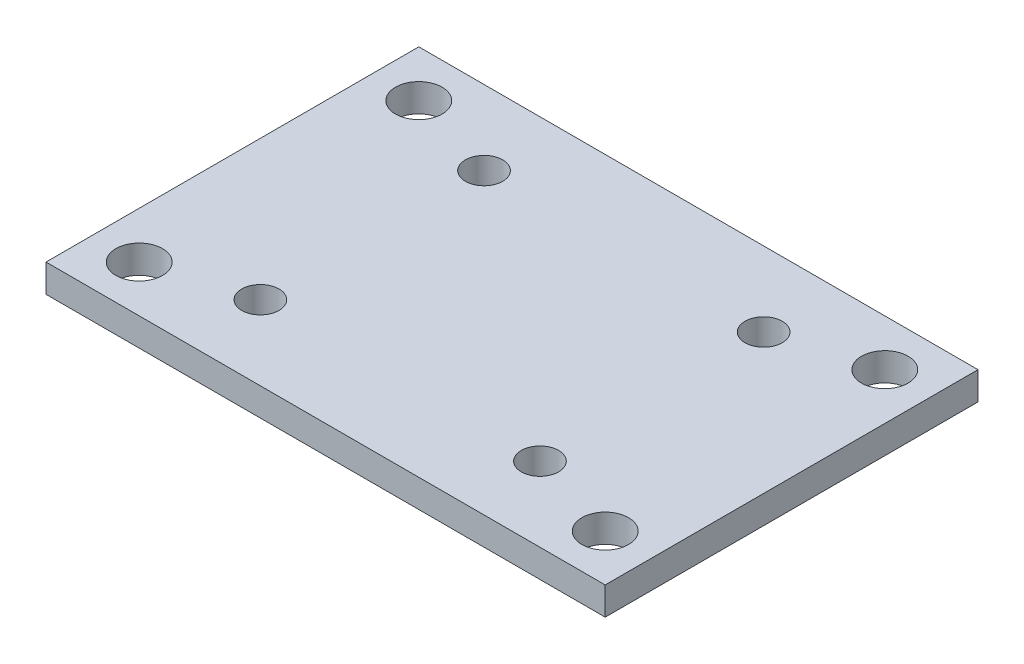
ISO-10303-21;
HEADER;
FILE_DESCRIPTION(('STEP AP214'),'2;1');
FILE_NAME('part.step','',(''),(''),'','','');
FILE_SCHEMA(('AUTOMOTIVE_DESIGN { 1 0 10303 214 1 1 1 1 }'));
ENDSEC;
DATA;
#1=APPLICATION_CONTEXT('core data for automotive mechanical design processes');
#2=APPLICATION_PROTOCOL_DEFINITION('international standard','automotive_design',2000,#1);
#3=PRODUCT_CONTEXT('',#1,'mechanical');
#4=PRODUCT('Part','Part','',(#3));
#5=PRODUCT_RELATED_PRODUCT_CATEGORY('part','',(#4));
#6=PRODUCT_DEFINITION_FORMATION('','',#4);
#7=PRODUCT_DEFINITION_CONTEXT('part definition',#1,'design');
#8=PRODUCT_DEFINITION('design','',#6,#7);
#9=PRODUCT_DEFINITION_SHAPE('','',#8);
#10=(LENGTH_UNIT() NAMED_UNIT(*) SI_UNIT(.MILLI.,.METRE.));
#11=(NAMED_UNIT(*) PLANE_ANGLE_UNIT() SI_UNIT($,.RADIAN.));
#12=(NAMED_UNIT(*) SI_UNIT($,.STERADIAN.) SOLID_ANGLE_UNIT());
#13=UNCERTAINTY_MEASURE_WITH_UNIT(LENGTH_MEASURE(1.E-05),#10,'distance_accuracy_value','');
#14=(GEOMETRIC_REPRESENTATION_CONTEXT(3) GLOBAL_UNCERTAINTY_ASSIGNED_CONTEXT((#13)) GLOBAL_UNIT_ASSIGNED_CONTEXT((#10,
#11,#12)) REPRESENTATION_CONTEXT('',''));
#15=CARTESIAN_POINT('',(0.,0.,0.));
#16=DIRECTION('',(0.,0.,1.));
#17=DIRECTION('',(1.,0.,0.));
#18=AXIS2_PLACEMENT_3D('',#15,#16,#17);
#19=CARTESIAN_POINT('',(-30.,3.,20.));
#20=DIRECTION('',(1.,0.,0.));
#21=DIRECTION('',(0.,0.,-1.));
#22=AXIS2_PLACEMENT_3D('',#19,#20,#21);
#23=PLANE('',#22);
#24=DIRECTION('',(0.,0.,1.));
#25=VECTOR('',#24,1.);
#26=CARTESIAN_POINT('',(-30.,0.,20.));
#27=LINE('',#26,#25);
#28=CARTESIAN_POINT('',(-30.,0.,-20.));
#29=VERTEX_POINT('',#28);
#30=CARTESIAN_POINT('',(-30.,0.,20.));
#31=VERTEX_POINT('',#30);
#32=EDGE_CURVE('E96',#29,#31,#27,.T.);
#33=ORIENTED_EDGE('',*,*,#32,.T.);
#34=DIRECTION('',(0.,-1.,0.));
#35=VECTOR('',#34,1.);
#36=CARTESIAN_POINT('',(-30.,3.,20.));
#37=LINE('',#36,#35);
#38=CARTESIAN_POINT('',(-30.,3.,20.));
#39=VERTEX_POINT('',#38);
#40=EDGE_CURVE('E11',#39,#31,#37,.T.);
#41=ORIENTED_EDGE('',*,*,#40,.F.);
#42=DIRECTION('',(0.,0.,1.));
#43=VECTOR('',#42,1.);
#44=CARTESIAN_POINT('',(-30.,3.,20.));
#45=LINE('',#44,#43);
#46=CARTESIAN_POINT('',(-30.,3.,-20.));
#47=VERTEX_POINT('',#46);
#48=EDGE_CURVE('E84',#47,#39,#45,.T.);
#49=ORIENTED_EDGE('',*,*,#48,.F.);
#50=DIRECTION('',(0.,-1.,0.));
#51=VECTOR('',#50,1.);
#52=CARTESIAN_POINT('',(-30.,3.,-20.));
#53=LINE('',#52,#51);
#54=EDGE_CURVE('E92',#47,#29,#53,.T.);
#55=ORIENTED_EDGE('',*,*,#54,.T.);
#56=EDGE_LOOP('',(#33,#41,#49,#55));
#57=FACE_BOUND('',#56,.T.);
#58=ADVANCED_FACE('F33',(#57),#23,.F.);
#59=CARTESIAN_POINT('',(30.,3.,20.));
#60=DIRECTION('',(0.,0.,-1.));
#61=DIRECTION('',(-1.,0.,0.));
#62=AXIS2_PLACEMENT_3D('',#59,#60,#61);
#63=PLANE('',#62);
#64=DIRECTION('',(1.,0.,0.));
#65=VECTOR('',#64,1.);
#66=CARTESIAN_POINT('',(30.,0.,20.));
#67=LINE('',#66,#65);
#68=CARTESIAN_POINT('',(30.,0.,20.));
#69=VERTEX_POINT('',#68);
#70=EDGE_CURVE('E88',#31,#69,#67,.T.);
#71=ORIENTED_EDGE('',*,*,#70,.T.);
#72=DIRECTION('',(0.,-1.,0.));
#73=VECTOR('',#72,1.);
#74=CARTESIAN_POINT('',(30.,3.,20.));
#75=LINE('',#74,#73);
#76=CARTESIAN_POINT('',(30.,3.,20.));
#77=VERTEX_POINT('',#76);
#78=EDGE_CURVE('E41',#77,#69,#75,.T.);
#79=ORIENTED_EDGE('',*,*,#78,.F.);
#80=DIRECTION('',(1.,0.,0.));
#81=VECTOR('',#80,1.);
#82=CARTESIAN_POINT('',(30.,3.,20.));
#83=LINE('',#82,#81);
#84=EDGE_CURVE('E79',#39,#77,#83,.T.);
#85=ORIENTED_EDGE('',*,*,#84,.F.);
#86=ORIENTED_EDGE('',*,*,#40,.T.);
#87=EDGE_LOOP('',(#71,#79,#85,#86));
#88=FACE_BOUND('',#87,.T.);
#89=ADVANCED_FACE('F87',(#88),#63,.F.);
#90=CARTESIAN_POINT('',(30.,3.,20.));
#91=DIRECTION('',(-1.,0.,0.));
#92=DIRECTION('',(0.,0.,1.));
#93=AXIS2_PLACEMENT_3D('',#90,#91,#92);
#94=PLANE('',#93);
#95=DIRECTION('',(0.,0.,-1.));
#96=VECTOR('',#95,1.);
#97=CARTESIAN_POINT('',(30.,0.,20.));
#98=LINE('',#97,#96);
#99=CARTESIAN_POINT('',(30.,0.,-20.));
#100=VERTEX_POINT('',#99);
#101=EDGE_CURVE('E66',#69,#100,#98,.T.);
#102=ORIENTED_EDGE('',*,*,#101,.T.);
#103=DIRECTION('',(0.,-1.,0.));
#104=VECTOR('',#103,1.);
#105=CARTESIAN_POINT('',(30.,3.,-20.));
#106=LINE('',#105,#104);
#107=CARTESIAN_POINT('',(30.,3.,-20.));
#108=VERTEX_POINT('',#107);
#109=EDGE_CURVE('E89',#108,#100,#106,.T.);
#110=ORIENTED_EDGE('',*,*,#109,.F.);
#111=DIRECTION('',(0.,0.,-1.));
#112=VECTOR('',#111,1.);
#113=CARTESIAN_POINT('',(30.,3.,20.));
#114=LINE('',#113,#112);
#115=EDGE_CURVE('E82',#77,#108,#114,.T.);
#116=ORIENTED_EDGE('',*,*,#115,.F.);
#117=ORIENTED_EDGE('',*,*,#78,.T.);
#118=EDGE_LOOP('',(#102,#110,#116,#117));
#119=FACE_BOUND('',#118,.T.);
#120=ADVANCED_FACE('F90',(#119),#94,.F.);
#121=CARTESIAN_POINT('',(30.,3.,-20.));
#122=DIRECTION('',(0.,0.,1.));
#123=DIRECTION('',(1.,0.,0.));
#124=AXIS2_PLACEMENT_3D('',#121,#122,#123);
#125=PLANE('',#124);
#126=DIRECTION('',(-1.,0.,0.));
#127=VECTOR('',#126,1.);
#128=CARTESIAN_POINT('',(30.,0.,-20.));
#129=LINE('',#128,#127);
#130=EDGE_CURVE('E72',#100,#29,#129,.T.);
#131=ORIENTED_EDGE('',*,*,#130,.T.);
#132=ORIENTED_EDGE('',*,*,#54,.F.);
#133=DIRECTION('',(-1.,0.,0.));
#134=VECTOR('',#133,1.);
#135=CARTESIAN_POINT('',(30.,3.,-20.));
#136=LINE('',#135,#134);
#137=EDGE_CURVE('E49',#108,#47,#136,.T.);
#138=ORIENTED_EDGE('',*,*,#137,.F.);
#139=ORIENTED_EDGE('',*,*,#109,.T.);
#140=EDGE_LOOP('',(#131,#132,#138,#139));
#141=FACE_BOUND('',#140,.T.);
#142=ADVANCED_FACE('F104',(#141),#125,.F.);
#143=CARTESIAN_POINT('',(0.,3.,0.));
#144=DIRECTION('',(0.,1.,0.));
#145=DIRECTION('',(0.,0.,1.));
#146=AXIS2_PLACEMENT_3D('',#143,#144,#145);
#147=PLANE('',#146);
#148=CARTESIAN_POINT('',(-25.,3.,15.));
#149=DIRECTION('',(0.,1.,0.));
#150=DIRECTION('',(0.,0.,1.));
#151=AXIS2_PLACEMENT_3D('',#148,#149,#150);
#152=CIRCLE('',#151,2.5);
#153=CARTESIAN_POINT('',(-25.,3.,17.5));
#154=VERTEX_POINT('',#153);
#155=EDGE_CURVE('E147',#154,#154,#152,.T.);
#156=ORIENTED_EDGE('',*,*,#155,.F.);
#157=EDGE_LOOP('',(#156));
#158=FACE_BOUND('',#157,.T.);
#159=CARTESIAN_POINT('',(25.,3.,-15.));
#160=DIRECTION('',(0.,1.,0.));
#161=DIRECTION('',(0.,0.,1.));
#162=AXIS2_PLACEMENT_3D('',#159,#160,#161);
#163=CIRCLE('',#162,2.5);
#164=CARTESIAN_POINT('',(25.,3.,-12.5));
#165=VERTEX_POINT('',#164);
#166=EDGE_CURVE('E140',#165,#165,#163,.T.);
#167=ORIENTED_EDGE('',*,*,#166,.F.);
#168=EDGE_LOOP('',(#167));
#169=FACE_BOUND('',#168,.T.);
#170=CARTESIAN_POINT('',(25.,3.,15.));
#171=DIRECTION('',(0.,1.,0.));
#172=DIRECTION('',(0.,0.,1.));
#173=AXIS2_PLACEMENT_3D('',#170,#171,#172);
#174=CIRCLE('',#173,2.5);
#175=CARTESIAN_POINT('',(25.,3.,17.5));
#176=VERTEX_POINT('',#175);
#177=EDGE_CURVE('E152',#176,#176,#174,.T.);
#178=ORIENTED_EDGE('',*,*,#177,.F.);
#179=EDGE_LOOP('',(#178));
#180=FACE_BOUND('',#179,.T.);
#181=CARTESIAN_POINT('',(-25.,3.,-15.));
#182=DIRECTION('',(0.,1.,0.));
#183=DIRECTION('',(0.,0.,1.));
#184=AXIS2_PLACEMENT_3D('',#181,#182,#183);
#185=CIRCLE('',#184,2.5);
#186=CARTESIAN_POINT('',(-25.,3.,-12.5));
#187=VERTEX_POINT('',#186);
#188=EDGE_CURVE('E134',#187,#187,#185,.T.);
#189=ORIENTED_EDGE('',*,*,#188,.F.);
#190=EDGE_LOOP('',(#189));
#191=FACE_BOUND('',#190,.T.);
#192=CARTESIAN_POINT('',(-15.,3.,12.));
#193=DIRECTION('',(0.,1.,0.));
#194=DIRECTION('',(0.,0.,1.));
#195=AXIS2_PLACEMENT_3D('',#192,#193,#194);
#196=CIRCLE('',#195,2.);
#197=CARTESIAN_POINT('',(-15.,3.,14.));
#198=VERTEX_POINT('',#197);
#199=EDGE_CURVE('E116',#198,#198,#196,.T.);
#200=ORIENTED_EDGE('',*,*,#199,.F.);
#201=EDGE_LOOP('',(#200));
#202=FACE_BOUND('',#201,.T.);
#203=CARTESIAN_POINT('',(15.,3.,12.));
#204=DIRECTION('',(0.,1.,0.));
#205=DIRECTION('',(0.,0.,1.));
#206=AXIS2_PLACEMENT_3D('',#203,#204,#205);
#207=CIRCLE('',#206,2.);
#208=CARTESIAN_POINT('',(15.,3.,14.));
#209=VERTEX_POINT('',#208);
#210=EDGE_CURVE('E123',#209,#209,#207,.T.);
#211=ORIENTED_EDGE('',*,*,#210,.F.);
#212=EDGE_LOOP('',(#211));
#213=FACE_BOUND('',#212,.T.);
#214=CARTESIAN_POINT('',(15.,3.,-12.));
#215=DIRECTION('',(0.,1.,0.));
#216=DIRECTION('',(0.,0.,1.));
#217=AXIS2_PLACEMENT_3D('',#214,#215,#216);
#218=CIRCLE('',#217,2.);
#219=CARTESIAN_POINT('',(15.,3.,-10.));
#220=VERTEX_POINT('',#219);
#221=EDGE_CURVE('E129',#220,#220,#218,.T.);
#222=ORIENTED_EDGE('',*,*,#221,.F.);
#223=EDGE_LOOP('',(#222));
#224=FACE_BOUND('',#223,.T.);
#225=CARTESIAN_POINT('',(-15.,3.,-12.));
#226=DIRECTION('',(0.,1.,0.));
#227=DIRECTION('',(0.,0.,1.));
#228=AXIS2_PLACEMENT_3D('',#225,#226,#227);
#229=CIRCLE('',#228,2.);
#230=CARTESIAN_POINT('',(-15.,3.,-10.));
#231=VERTEX_POINT('',#230);
#232=EDGE_CURVE('E110',#231,#231,#229,.T.);
#233=ORIENTED_EDGE('',*,*,#232,.F.);
#234=EDGE_LOOP('',(#233));
#235=FACE_BOUND('',#234,.T.);
#236=ORIENTED_EDGE('',*,*,#48,.T.);
#237=ORIENTED_EDGE('',*,*,#84,.T.);
#238=ORIENTED_EDGE('',*,*,#115,.T.);
#239=ORIENTED_EDGE('',*,*,#137,.T.);
#240=EDGE_LOOP('',(#236,#237,#238,#239));
#241=FACE_BOUND('',#240,.T.);
#242=ADVANCED_FACE('F80',(#158,#169,#180,#191,#202,#213,#224,#235,#241),#147,.T.);
#243=CARTESIAN_POINT('',(0.,0.,0.));
#244=DIRECTION('',(0.,1.,0.));
#245=DIRECTION('',(0.,0.,1.));
#246=AXIS2_PLACEMENT_3D('',#243,#244,#245);
#247=PLANE('',#246);
#248=CARTESIAN_POINT('',(-25.,0.,15.));
#249=DIRECTION('',(0.,1.,0.));
#250=DIRECTION('',(0.,0.,1.));
#251=AXIS2_PLACEMENT_3D('',#248,#249,#250);
#252=CIRCLE('',#251,2.5);
#253=CARTESIAN_POINT('',(-25.,0.,17.5));
#254=VERTEX_POINT('',#253);
#255=EDGE_CURVE('E137',#254,#254,#252,.T.);
#256=ORIENTED_EDGE('',*,*,#255,.T.);
#257=EDGE_LOOP('',(#256));
#258=FACE_BOUND('',#257,.T.);
#259=CARTESIAN_POINT('',(25.,0.,-15.));
#260=DIRECTION('',(0.,1.,0.));
#261=DIRECTION('',(0.,0.,1.));
#262=AXIS2_PLACEMENT_3D('',#259,#260,#261);
#263=CIRCLE('',#262,2.5);
#264=CARTESIAN_POINT('',(25.,0.,-12.5));
#265=VERTEX_POINT('',#264);
#266=EDGE_CURVE('E143',#265,#265,#263,.T.);
#267=ORIENTED_EDGE('',*,*,#266,.T.);
#268=EDGE_LOOP('',(#267));
#269=FACE_BOUND('',#268,.T.);
#270=CARTESIAN_POINT('',(25.,0.,15.));
#271=DIRECTION('',(0.,1.,0.));
#272=DIRECTION('',(0.,0.,1.));
#273=AXIS2_PLACEMENT_3D('',#270,#271,#272);
#274=CIRCLE('',#273,2.5);
#275=CARTESIAN_POINT('',(25.,0.,17.5));
#276=VERTEX_POINT('',#275);
#277=EDGE_CURVE('E144',#276,#276,#274,.T.);
#278=ORIENTED_EDGE('',*,*,#277,.T.);
#279=EDGE_LOOP('',(#278));
#280=FACE_BOUND('',#279,.T.);
#281=CARTESIAN_POINT('',(-25.,0.,-15.));
#282=DIRECTION('',(0.,1.,0.));
#283=DIRECTION('',(0.,0.,1.));
#284=AXIS2_PLACEMENT_3D('',#281,#282,#283);
#285=CIRCLE('',#284,2.5);
#286=CARTESIAN_POINT('',(-25.,0.,-12.5));
#287=VERTEX_POINT('',#286);
#288=EDGE_CURVE('E120',#287,#287,#285,.T.);
#289=ORIENTED_EDGE('',*,*,#288,.T.);
#290=EDGE_LOOP('',(#289));
#291=FACE_BOUND('',#290,.T.);
#292=CARTESIAN_POINT('',(-15.,0.,12.));
#293=DIRECTION('',(0.,1.,0.));
#294=DIRECTION('',(0.,0.,1.));
#295=AXIS2_PLACEMENT_3D('',#292,#293,#294);
#296=CIRCLE('',#295,2.);
#297=CARTESIAN_POINT('',(-15.,0.,14.));
#298=VERTEX_POINT('',#297);
#299=EDGE_CURVE('E119',#298,#298,#296,.T.);
#300=ORIENTED_EDGE('',*,*,#299,.T.);
#301=EDGE_LOOP('',(#300));
#302=FACE_BOUND('',#301,.T.);
#303=CARTESIAN_POINT('',(15.,0.,12.));
#304=DIRECTION('',(0.,1.,0.));
#305=DIRECTION('',(0.,0.,1.));
#306=AXIS2_PLACEMENT_3D('',#303,#304,#305);
#307=CIRCLE('',#306,2.);
#308=CARTESIAN_POINT('',(15.,0.,14.));
#309=VERTEX_POINT('',#308);
#310=EDGE_CURVE('E126',#309,#309,#307,.T.);
#311=ORIENTED_EDGE('',*,*,#310,.T.);
#312=EDGE_LOOP('',(#311));
#313=FACE_BOUND('',#312,.T.);
#314=CARTESIAN_POINT('',(15.,0.,-12.));
#315=DIRECTION('',(0.,1.,0.));
#316=DIRECTION('',(0.,0.,1.));
#317=AXIS2_PLACEMENT_3D('',#314,#315,#316);
#318=CIRCLE('',#317,2.);
#319=CARTESIAN_POINT('',(15.,0.,-10.));
#320=VERTEX_POINT('',#319);
#321=EDGE_CURVE('E113',#320,#320,#318,.T.);
#322=ORIENTED_EDGE('',*,*,#321,.T.);
#323=EDGE_LOOP('',(#322));
#324=FACE_BOUND('',#323,.T.);
#325=CARTESIAN_POINT('',(-15.,0.,-12.));
#326=DIRECTION('',(0.,1.,0.));
#327=DIRECTION('',(0.,0.,1.));
#328=AXIS2_PLACEMENT_3D('',#325,#326,#327);
#329=CIRCLE('',#328,2.);
#330=CARTESIAN_POINT('',(-15.,0.,-10.));
#331=VERTEX_POINT('',#330);
#332=EDGE_CURVE('E99',#331,#331,#329,.T.);
#333=ORIENTED_EDGE('',*,*,#332,.T.);
#334=EDGE_LOOP('',(#333));
#335=FACE_BOUND('',#334,.T.);
#336=ORIENTED_EDGE('',*,*,#32,.F.);
#337=ORIENTED_EDGE('',*,*,#130,.F.);
#338=ORIENTED_EDGE('',*,*,#101,.F.);
#339=ORIENTED_EDGE('',*,*,#70,.F.);
#340=EDGE_LOOP('',(#336,#337,#338,#339));
#341=FACE_BOUND('',#340,.T.);
#342=ADVANCED_FACE('F107',(#258,#269,#280,#291,#302,#313,#324,#335,#341),#247,.F.);
#343=CARTESIAN_POINT('',(-15.,0.,-12.));
#344=DIRECTION('',(0.,1.,0.));
#345=DIRECTION('',(0.,0.,1.));
#346=AXIS2_PLACEMENT_3D('',#343,#344,#345);
#347=CYLINDRICAL_SURFACE('',#346,2.);
#348=ORIENTED_EDGE('',*,*,#332,.F.);
#349=EDGE_LOOP('',(#348));
#350=FACE_BOUND('',#349,.T.);
#351=ORIENTED_EDGE('',*,*,#232,.T.);
#352=EDGE_LOOP('',(#351));
#353=FACE_BOUND('',#352,.T.);
#354=ADVANCED_FACE('F182',(#350,#353),#347,.F.);
#355=CARTESIAN_POINT('',(15.,0.,-12.));
#356=DIRECTION('',(0.,1.,0.));
#357=DIRECTION('',(0.,0.,1.));
#358=AXIS2_PLACEMENT_3D('',#355,#356,#357);
#359=CYLINDRICAL_SURFACE('',#358,2.);
#360=ORIENTED_EDGE('',*,*,#321,.F.);
#361=EDGE_LOOP('',(#360));
#362=FACE_BOUND('',#361,.T.);
#363=ORIENTED_EDGE('',*,*,#221,.T.);
#364=EDGE_LOOP('',(#363));
#365=FACE_BOUND('',#364,.T.);
#366=ADVANCED_FACE('F184',(#362,#365),#359,.F.);
#367=CARTESIAN_POINT('',(15.,0.,12.));
#368=DIRECTION('',(0.,1.,0.));
#369=DIRECTION('',(0.,0.,1.));
#370=AXIS2_PLACEMENT_3D('',#367,#368,#369);
#371=CYLINDRICAL_SURFACE('',#370,2.);
#372=ORIENTED_EDGE('',*,*,#310,.F.);
#373=EDGE_LOOP('',(#372));
#374=FACE_BOUND('',#373,.T.);
#375=ORIENTED_EDGE('',*,*,#210,.T.);
#376=EDGE_LOOP('',(#375));
#377=FACE_BOUND('',#376,.T.);
#378=ADVANCED_FACE('F191',(#374,#377),#371,.F.);
#379=CARTESIAN_POINT('',(-15.,0.,12.));
#380=DIRECTION('',(0.,1.,0.));
#381=DIRECTION('',(0.,0.,1.));
#382=AXIS2_PLACEMENT_3D('',#379,#380,#381);
#383=CYLINDRICAL_SURFACE('',#382,2.);
#384=ORIENTED_EDGE('',*,*,#299,.F.);
#385=EDGE_LOOP('',(#384));
#386=FACE_BOUND('',#385,.T.);
#387=ORIENTED_EDGE('',*,*,#199,.T.);
#388=EDGE_LOOP('',(#387));
#389=FACE_BOUND('',#388,.T.);
#390=ADVANCED_FACE('F231',(#386,#389),#383,.F.);
#391=CARTESIAN_POINT('',(-25.,0.,-15.));
#392=DIRECTION('',(0.,1.,0.));
#393=DIRECTION('',(0.,0.,1.));
#394=AXIS2_PLACEMENT_3D('',#391,#392,#393);
#395=CYLINDRICAL_SURFACE('',#394,2.5);
#396=ORIENTED_EDGE('',*,*,#288,.F.);
#397=EDGE_LOOP('',(#396));
#398=FACE_BOUND('',#397,.T.);
#399=ORIENTED_EDGE('',*,*,#188,.T.);
#400=EDGE_LOOP('',(#399));
#401=FACE_BOUND('',#400,.T.);
#402=ADVANCED_FACE('F164',(#398,#401),#395,.F.);
#403=CARTESIAN_POINT('',(25.,0.,15.));
#404=DIRECTION('',(0.,1.,0.));
#405=DIRECTION('',(0.,0.,1.));
#406=AXIS2_PLACEMENT_3D('',#403,#404,#405);
#407=CYLINDRICAL_SURFACE('',#406,2.5);
#408=ORIENTED_EDGE('',*,*,#277,.F.);
#409=EDGE_LOOP('',(#408));
#410=FACE_BOUND('',#409,.T.);
#411=ORIENTED_EDGE('',*,*,#177,.T.);
#412=EDGE_LOOP('',(#411));
#413=FACE_BOUND('',#412,.T.);
#414=ADVANCED_FACE('F160',(#410,#413),#407,.F.);
#415=CARTESIAN_POINT('',(25.,0.,-15.));
#416=DIRECTION('',(0.,1.,0.));
#417=DIRECTION('',(0.,0.,1.));
#418=AXIS2_PLACEMENT_3D('',#415,#416,#417);
#419=CYLINDRICAL_SURFACE('',#418,2.5);
#420=ORIENTED_EDGE('',*,*,#266,.F.);
#421=EDGE_LOOP('',(#420));
#422=FACE_BOUND('',#421,.T.);
#423=ORIENTED_EDGE('',*,*,#166,.T.);
#424=EDGE_LOOP('',(#423));
#425=FACE_BOUND('',#424,.T.);
#426=ADVANCED_FACE('F163',(#422,#425),#419,.F.);
#427=CARTESIAN_POINT('',(-25.,0.,15.));
#428=DIRECTION('',(0.,1.,0.));
#429=DIRECTION('',(0.,0.,1.));
#430=AXIS2_PLACEMENT_3D('',#427,#428,#429);
#431=CYLINDRICAL_SURFACE('',#430,2.5);
#432=ORIENTED_EDGE('',*,*,#255,.F.);
#433=EDGE_LOOP('',(#432));
#434=FACE_BOUND('',#433,.T.);
#435=ORIENTED_EDGE('',*,*,#155,.T.);
#436=EDGE_LOOP('',(#435));
#437=FACE_BOUND('',#436,.T.);
#438=ADVANCED_FACE('F249',(#434,#437),#431,.F.);
#439=CLOSED_SHELL('',(#58,#89,#120,#142,#242,#342,#354,#366,#378,#390,#402,#414,#426,#438));
#440=MANIFOLD_SOLID_BREP('B2',#439);
#441=ADVANCED_BREP_SHAPE_REPRESENTATION('',(#18,#440),#14);
#442=SHAPE_DEFINITION_REPRESENTATION(#9,#441);
ENDSEC;
END-ISO-10303-21;
